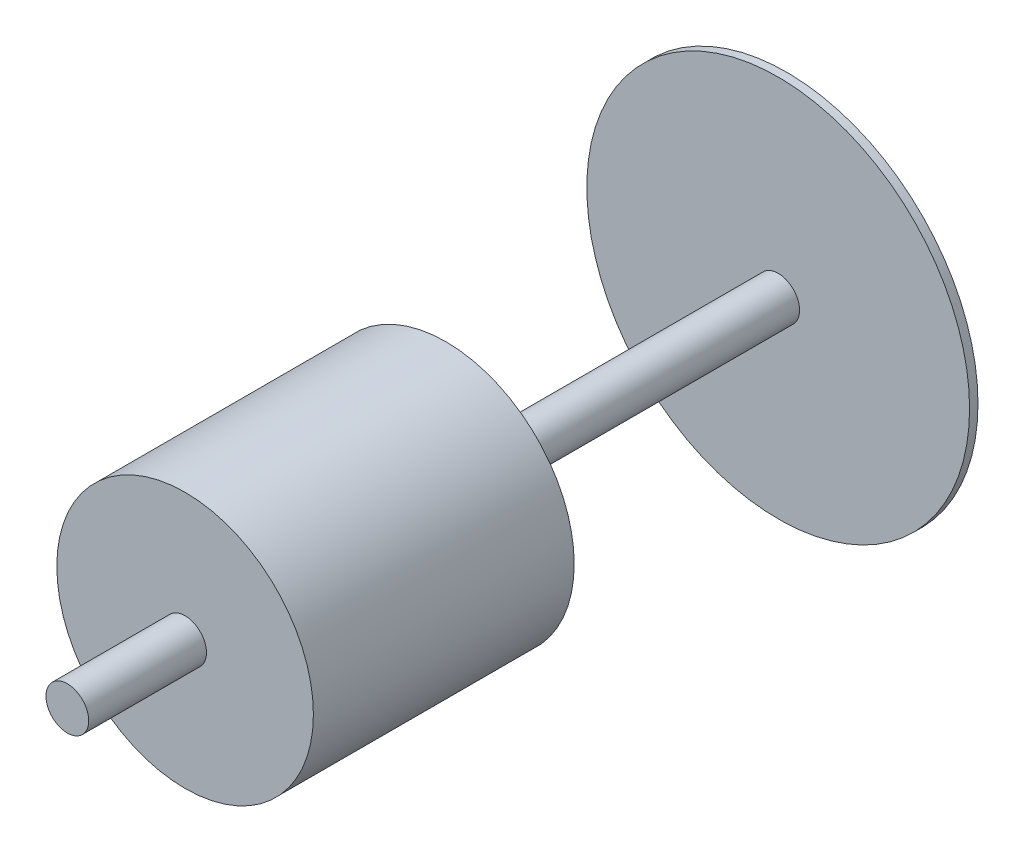
ISO-10303-21;
HEADER;
FILE_DESCRIPTION(('STEP AP214'),'2;1');
FILE_NAME('part.step','',(''),(''),'','','');
FILE_SCHEMA(('AUTOMOTIVE_DESIGN { 1 0 10303 214 1 1 1 1 }'));
ENDSEC;
DATA;
#1=APPLICATION_CONTEXT('core data for automotive mechanical design processes');
#2=APPLICATION_PROTOCOL_DEFINITION('international standard','automotive_design',2000,#1);
#3=PRODUCT_CONTEXT('',#1,'mechanical');
#4=PRODUCT('Part','Part','',(#3));
#5=PRODUCT_RELATED_PRODUCT_CATEGORY('part','',(#4));
#6=PRODUCT_DEFINITION_FORMATION('','',#4);
#7=PRODUCT_DEFINITION_CONTEXT('part definition',#1,'design');
#8=PRODUCT_DEFINITION('design','',#6,#7);
#9=PRODUCT_DEFINITION_SHAPE('','',#8);
#10=(LENGTH_UNIT() NAMED_UNIT(*) SI_UNIT(.MILLI.,.METRE.));
#11=(NAMED_UNIT(*) PLANE_ANGLE_UNIT() SI_UNIT($,.RADIAN.));
#12=(NAMED_UNIT(*) SI_UNIT($,.STERADIAN.) SOLID_ANGLE_UNIT());
#13=UNCERTAINTY_MEASURE_WITH_UNIT(LENGTH_MEASURE(1.E-05),#10,'distance_accuracy_value','');
#14=(GEOMETRIC_REPRESENTATION_CONTEXT(3) GLOBAL_UNCERTAINTY_ASSIGNED_CONTEXT((#13)) GLOBAL_UNIT_ASSIGNED_CONTEXT((#10,
#11,#12)) REPRESENTATION_CONTEXT('',''));
#15=CARTESIAN_POINT('',(0.,0.,0.));
#16=DIRECTION('',(0.,0.,1.));
#17=DIRECTION('',(1.,0.,0.));
#18=AXIS2_PLACEMENT_3D('',#15,#16,#17);
#19=CARTESIAN_POINT('',(0.,0.,130.));
#20=DIRECTION('',(0.,0.,1.));
#21=DIRECTION('',(1.,0.,0.));
#22=AXIS2_PLACEMENT_3D('',#19,#20,#21);
#23=CYLINDRICAL_SURFACE('',#22,305.);
#24=CARTESIAN_POINT('',(0.,0.,130.));
#25=DIRECTION('',(0.,0.,1.));
#26=DIRECTION('',(1.,0.,0.));
#27=AXIS2_PLACEMENT_3D('',#24,#25,#26);
#28=CIRCLE('',#27,305.);
#29=CARTESIAN_POINT('',(305.,0.,130.));
#30=VERTEX_POINT('',#29);
#31=EDGE_CURVE('E67',#30,#30,#28,.T.);
#32=ORIENTED_EDGE('',*,*,#31,.T.);
#33=EDGE_LOOP('',(#32));
#34=FACE_BOUND('',#33,.T.);
#35=CARTESIAN_POINT('',(0.,0.,750.));
#36=DIRECTION('',(0.,0.,1.));
#37=DIRECTION('',(1.,0.,0.));
#38=AXIS2_PLACEMENT_3D('',#35,#36,#37);
#39=CIRCLE('',#38,305.);
#40=CARTESIAN_POINT('',(305.,0.,750.));
#41=VERTEX_POINT('',#40);
#42=EDGE_CURVE('E78',#41,#41,#39,.T.);
#43=ORIENTED_EDGE('',*,*,#42,.F.);
#44=EDGE_LOOP('',(#43));
#45=FACE_BOUND('',#44,.T.);
#46=ADVANCED_FACE('F45',(#34,#45),#23,.T.);
#47=CARTESIAN_POINT('',(0.,0.,130.));
#48=DIRECTION('',(0.,0.,1.));
#49=DIRECTION('',(1.,0.,0.));
#50=AXIS2_PLACEMENT_3D('',#47,#48,#49);
#51=PLANE('',#50);
#52=CARTESIAN_POINT('',(0.,0.,130.));
#53=DIRECTION('',(0.,0.,1.));
#54=DIRECTION('',(1.,0.,0.));
#55=AXIS2_PLACEMENT_3D('',#52,#53,#54);
#56=CIRCLE('',#55,225.);
#57=CARTESIAN_POINT('',(225.,0.,130.));
#58=VERTEX_POINT('',#57);
#59=EDGE_CURVE('E10',#58,#58,#56,.F.);
#60=ORIENTED_EDGE('',*,*,#59,.F.);
#61=EDGE_LOOP('',(#60));
#62=FACE_BOUND('',#61,.T.);
#63=ORIENTED_EDGE('',*,*,#31,.F.);
#64=EDGE_LOOP('',(#63));
#65=FACE_BOUND('',#64,.T.);
#66=ADVANCED_FACE('F113',(#62,#65),#51,.F.);
#67=CARTESIAN_POINT('',(0.,0.,750.));
#68=DIRECTION('',(0.,0.,1.));
#69=DIRECTION('',(1.,0.,0.));
#70=AXIS2_PLACEMENT_3D('',#67,#68,#69);
#71=PLANE('',#70);
#72=CARTESIAN_POINT('',(0.,0.,750.));
#73=DIRECTION('',(0.,0.,1.));
#74=DIRECTION('',(1.,0.,0.));
#75=AXIS2_PLACEMENT_3D('',#72,#73,#74);
#76=CIRCLE('',#75,50.8);
#77=CARTESIAN_POINT('',(50.8,0.,750.));
#78=VERTEX_POINT('',#77);
#79=EDGE_CURVE('E62',#78,#78,#76,.T.);
#80=ORIENTED_EDGE('',*,*,#79,.F.);
#81=EDGE_LOOP('',(#80));
#82=FACE_BOUND('',#81,.T.);
#83=ORIENTED_EDGE('',*,*,#42,.T.);
#84=EDGE_LOOP('',(#83));
#85=FACE_BOUND('',#84,.T.);
#86=ADVANCED_FACE('F120',(#82,#85),#71,.T.);
#87=CARTESIAN_POINT('',(0.,0.,1030.));
#88=DIRECTION('',(0.,0.,1.));
#89=DIRECTION('',(1.,0.,0.));
#90=AXIS2_PLACEMENT_3D('',#87,#88,#89);
#91=PLANE('',#90);
#92=CARTESIAN_POINT('',(0.,0.,1030.));
#93=DIRECTION('',(0.,0.,1.));
#94=DIRECTION('',(1.,0.,0.));
#95=AXIS2_PLACEMENT_3D('',#92,#93,#94);
#96=CIRCLE('',#95,50.8);
#97=CARTESIAN_POINT('',(50.8,0.,1030.));
#98=VERTEX_POINT('',#97);
#99=EDGE_CURVE('E54',#98,#98,#96,.T.);
#100=ORIENTED_EDGE('',*,*,#99,.T.);
#101=EDGE_LOOP('',(#100));
#102=FACE_BOUND('',#101,.T.);
#103=ADVANCED_FACE('F132',(#102),#91,.T.);
#104=CARTESIAN_POINT('',(0.,0.,1030.));
#105=DIRECTION('',(0.,0.,-1.));
#106=DIRECTION('',(-1.,0.,0.));
#107=AXIS2_PLACEMENT_3D('',#104,#105,#106);
#108=CYLINDRICAL_SURFACE('',#107,50.8);
#109=ORIENTED_EDGE('',*,*,#79,.T.);
#110=EDGE_LOOP('',(#109));
#111=FACE_BOUND('',#110,.T.);
#112=ORIENTED_EDGE('',*,*,#99,.F.);
#113=EDGE_LOOP('',(#112));
#114=FACE_BOUND('',#113,.T.);
#115=ADVANCED_FACE('F47',(#111,#114),#108,.T.);
#116=CARTESIAN_POINT('',(0.,0.,80.));
#117=DIRECTION('',(0.,0.,1.));
#118=DIRECTION('',(1.,0.,0.));
#119=AXIS2_PLACEMENT_3D('',#116,#117,#118);
#120=CYLINDRICAL_SURFACE('',#119,225.);
#121=CARTESIAN_POINT('',(0.,0.,80.));
#122=DIRECTION('',(0.,0.,-1.));
#123=DIRECTION('',(-1.,0.,0.));
#124=AXIS2_PLACEMENT_3D('',#121,#122,#123);
#125=CIRCLE('',#124,225.);
#126=CARTESIAN_POINT('',(-225.,0.,80.));
#127=VERTEX_POINT('',#126);
#128=EDGE_CURVE('E85',#127,#127,#125,.T.);
#129=ORIENTED_EDGE('',*,*,#128,.F.);
#130=EDGE_LOOP('',(#129));
#131=FACE_BOUND('',#130,.T.);
#132=ORIENTED_EDGE('',*,*,#59,.T.);
#133=EDGE_LOOP('',(#132));
#134=FACE_BOUND('',#133,.T.);
#135=ADVANCED_FACE('F100',(#131,#134),#120,.T.);
#136=CARTESIAN_POINT('',(0.,0.,80.));
#137=DIRECTION('',(0.,0.,-1.));
#138=DIRECTION('',(-1.,0.,0.));
#139=AXIS2_PLACEMENT_3D('',#136,#137,#138);
#140=PLANE('',#139);
#141=CARTESIAN_POINT('',(0.,0.,80.));
#142=DIRECTION('',(0.,0.,-1.));
#143=DIRECTION('',(-1.,0.,0.));
#144=AXIS2_PLACEMENT_3D('',#141,#142,#143);
#145=CIRCLE('',#144,50.8);
#146=CARTESIAN_POINT('',(-50.8,0.,80.));
#147=VERTEX_POINT('',#146);
#148=EDGE_CURVE('E49',#147,#147,#145,.T.);
#149=ORIENTED_EDGE('',*,*,#148,.F.);
#150=EDGE_LOOP('',(#149));
#151=FACE_BOUND('',#150,.T.);
#152=ORIENTED_EDGE('',*,*,#128,.T.);
#153=EDGE_LOOP('',(#152));
#154=FACE_BOUND('',#153,.T.);
#155=ADVANCED_FACE('F97',(#151,#154),#140,.T.);
#156=CARTESIAN_POINT('',(0.,0.,-680.));
#157=DIRECTION('',(0.,0.,1.));
#158=DIRECTION('',(1.,0.,0.));
#159=AXIS2_PLACEMENT_3D('',#156,#157,#158);
#160=PLANE('',#159);
#161=CARTESIAN_POINT('',(0.,0.,-680.));
#162=DIRECTION('',(0.,0.,1.));
#163=DIRECTION('',(1.,0.,0.));
#164=AXIS2_PLACEMENT_3D('',#161,#162,#163);
#165=CIRCLE('',#164,455.);
#166=CARTESIAN_POINT('',(455.,0.,-680.));
#167=VERTEX_POINT('',#166);
#168=EDGE_CURVE('E66',#167,#167,#165,.T.);
#169=ORIENTED_EDGE('',*,*,#168,.F.);
#170=EDGE_LOOP('',(#169));
#171=FACE_BOUND('',#170,.T.);
#172=ADVANCED_FACE('F99',(#171),#160,.F.);
#173=CARTESIAN_POINT('',(0.,0.,-660.));
#174=DIRECTION('',(0.,0.,-1.));
#175=DIRECTION('',(-1.,0.,0.));
#176=AXIS2_PLACEMENT_3D('',#173,#174,#175);
#177=CYLINDRICAL_SURFACE('',#176,455.);
#178=CARTESIAN_POINT('',(0.,0.,-660.));
#179=DIRECTION('',(0.,0.,1.));
#180=DIRECTION('',(1.,0.,0.));
#181=AXIS2_PLACEMENT_3D('',#178,#179,#180);
#182=CIRCLE('',#181,455.);
#183=CARTESIAN_POINT('',(455.,0.,-660.));
#184=VERTEX_POINT('',#183);
#185=EDGE_CURVE('E70',#184,#184,#182,.T.);
#186=ORIENTED_EDGE('',*,*,#185,.F.);
#187=EDGE_LOOP('',(#186));
#188=FACE_BOUND('',#187,.T.);
#189=ORIENTED_EDGE('',*,*,#168,.T.);
#190=EDGE_LOOP('',(#189));
#191=FACE_BOUND('',#190,.T.);
#192=ADVANCED_FACE('F107',(#188,#191),#177,.T.);
#193=CARTESIAN_POINT('',(0.,0.,-660.));
#194=DIRECTION('',(0.,0.,1.));
#195=DIRECTION('',(1.,0.,0.));
#196=AXIS2_PLACEMENT_3D('',#193,#194,#195);
#197=PLANE('',#196);
#198=CARTESIAN_POINT('',(0.,0.,-660.));
#199=DIRECTION('',(0.,0.,1.));
#200=DIRECTION('',(1.,0.,0.));
#201=AXIS2_PLACEMENT_3D('',#198,#199,#200);
#202=CIRCLE('',#201,50.8);
#203=CARTESIAN_POINT('',(50.8,0.,-660.));
#204=VERTEX_POINT('',#203);
#205=EDGE_CURVE('E59',#204,#204,#202,.T.);
#206=ORIENTED_EDGE('',*,*,#205,.F.);
#207=EDGE_LOOP('',(#206));
#208=FACE_BOUND('',#207,.T.);
#209=ORIENTED_EDGE('',*,*,#185,.T.);
#210=EDGE_LOOP('',(#209));
#211=FACE_BOUND('',#210,.T.);
#212=ADVANCED_FACE('F126',(#208,#211),#197,.T.);
#213=ORIENTED_EDGE('',*,*,#148,.T.);
#214=EDGE_LOOP('',(#213));
#215=FACE_BOUND('',#214,.T.);
#216=ORIENTED_EDGE('',*,*,#205,.T.);
#217=EDGE_LOOP('',(#216));
#218=FACE_BOUND('',#217,.T.);
#219=ADVANCED_FACE('F94',(#215,#218),#108,.T.);
#220=CLOSED_SHELL('',(#46,#66,#86,#103,#115,#135,#155,#172,#192,#212,#219));
#221=MANIFOLD_SOLID_BREP('B2',#220);
#222=ADVANCED_BREP_SHAPE_REPRESENTATION('',(#18,#221),#14);
#223=SHAPE_DEFINITION_REPRESENTATION(#9,#222);
ENDSEC;
END-ISO-10303-21;
